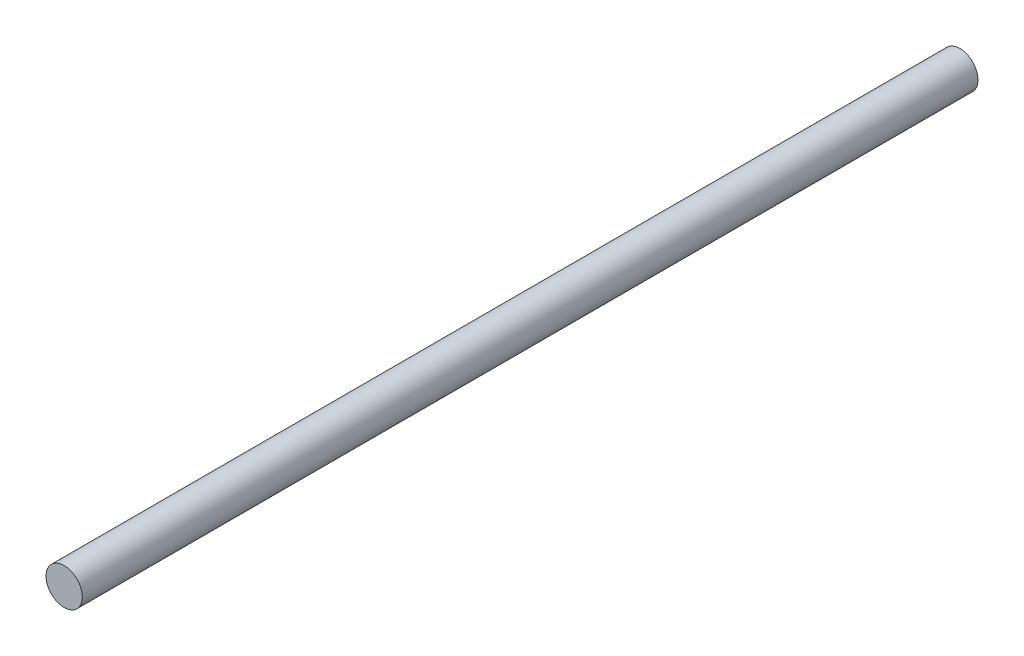
ISO-10303-21;
HEADER;
FILE_DESCRIPTION(('STEP AP214'),'2;1');
FILE_NAME('part.step','',(''),(''),'','','');
FILE_SCHEMA(('AUTOMOTIVE_DESIGN { 1 0 10303 214 1 1 1 1 }'));
ENDSEC;
DATA;
#1=APPLICATION_CONTEXT('core data for automotive mechanical design processes');
#2=APPLICATION_PROTOCOL_DEFINITION('international standard','automotive_design',2000,#1);
#3=PRODUCT_CONTEXT('',#1,'mechanical');
#4=PRODUCT('Part','Part','',(#3));
#5=PRODUCT_RELATED_PRODUCT_CATEGORY('part','',(#4));
#6=PRODUCT_DEFINITION_FORMATION('','',#4);
#7=PRODUCT_DEFINITION_CONTEXT('part definition',#1,'design');
#8=PRODUCT_DEFINITION('design','',#6,#7);
#9=PRODUCT_DEFINITION_SHAPE('','',#8);
#10=(LENGTH_UNIT() NAMED_UNIT(*) SI_UNIT(.MILLI.,.METRE.));
#11=(NAMED_UNIT(*) PLANE_ANGLE_UNIT() SI_UNIT($,.RADIAN.));
#12=(NAMED_UNIT(*) SI_UNIT($,.STERADIAN.) SOLID_ANGLE_UNIT());
#13=UNCERTAINTY_MEASURE_WITH_UNIT(LENGTH_MEASURE(1.E-05),#10,'distance_accuracy_value','');
#14=(GEOMETRIC_REPRESENTATION_CONTEXT(3) GLOBAL_UNCERTAINTY_ASSIGNED_CONTEXT((#13)) GLOBAL_UNIT_ASSIGNED_CONTEXT((#10,
#11,#12)) REPRESENTATION_CONTEXT('',''));
#15=CARTESIAN_POINT('',(0.,0.,0.));
#16=DIRECTION('',(0.,0.,1.));
#17=DIRECTION('',(1.,0.,0.));
#18=AXIS2_PLACEMENT_3D('',#15,#16,#17);
#19=CARTESIAN_POINT('',(0.,0.,0.));
#20=DIRECTION('',(0.,0.,1.));
#21=DIRECTION('',(1.,0.,0.));
#22=AXIS2_PLACEMENT_3D('',#19,#20,#21);
#23=PLANE('',#22);
#24=CARTESIAN_POINT('',(0.,0.,0.));
#25=DIRECTION('',(0.,0.,1.));
#26=DIRECTION('',(1.,0.,0.));
#27=AXIS2_PLACEMENT_3D('',#24,#25,#26);
#28=CIRCLE('',#27,1.5);
#29=CARTESIAN_POINT('',(1.5,0.,0.));
#30=VERTEX_POINT('',#29);
#31=EDGE_CURVE('E35',#30,#30,#28,.T.);
#32=ORIENTED_EDGE('',*,*,#31,.F.);
#33=EDGE_LOOP('',(#32));
#34=FACE_BOUND('',#33,.T.);
#35=ADVANCED_FACE('F31',(#34),#23,.F.);
#36=CARTESIAN_POINT('',(0.,0.,78.2426406871193));
#37=DIRECTION('',(0.,0.,-1.));
#38=DIRECTION('',(-1.,0.,0.));
#39=AXIS2_PLACEMENT_3D('',#36,#37,#38);
#40=CYLINDRICAL_SURFACE('',#39,1.5);
#41=CARTESIAN_POINT('',(0.,0.,74.));
#42=DIRECTION('',(0.,0.,-1.));
#43=DIRECTION('',(0.,-1.,0.));
#44=AXIS2_PLACEMENT_3D('',#41,#42,#43);
#45=CIRCLE('',#44,1.5);
#46=CARTESIAN_POINT('',(0.,-1.50000000000001,74.));
#47=VERTEX_POINT('',#46);
#48=EDGE_CURVE('E10',#47,#47,#45,.F.);
#49=ORIENTED_EDGE('',*,*,#48,.F.);
#50=EDGE_LOOP('',(#49));
#51=FACE_BOUND('',#50,.T.);
#52=ORIENTED_EDGE('',*,*,#31,.T.);
#53=EDGE_LOOP('',(#52));
#54=FACE_BOUND('',#53,.T.);
#55=ADVANCED_FACE('F33',(#51,#54),#40,.T.);
#56=CARTESIAN_POINT('',(0.,0.,74.));
#57=DIRECTION('',(0.,0.,-1.));
#58=DIRECTION('',(0.,-1.,0.));
#59=AXIS2_PLACEMENT_3D('',#56,#57,#58);
#60=PLANE('',#59);
#61=ORIENTED_EDGE('',*,*,#48,.T.);
#62=EDGE_LOOP('',(#61));
#63=FACE_BOUND('',#62,.T.);
#64=ADVANCED_FACE('F49',(#63),#60,.F.);
#65=CLOSED_SHELL('',(#35,#55,#64));
#66=MANIFOLD_SOLID_BREP('B2',#65);
#67=ADVANCED_BREP_SHAPE_REPRESENTATION('',(#18,#66),#14);
#68=SHAPE_DEFINITION_REPRESENTATION(#9,#67);
ENDSEC;
END-ISO-10303-21;
